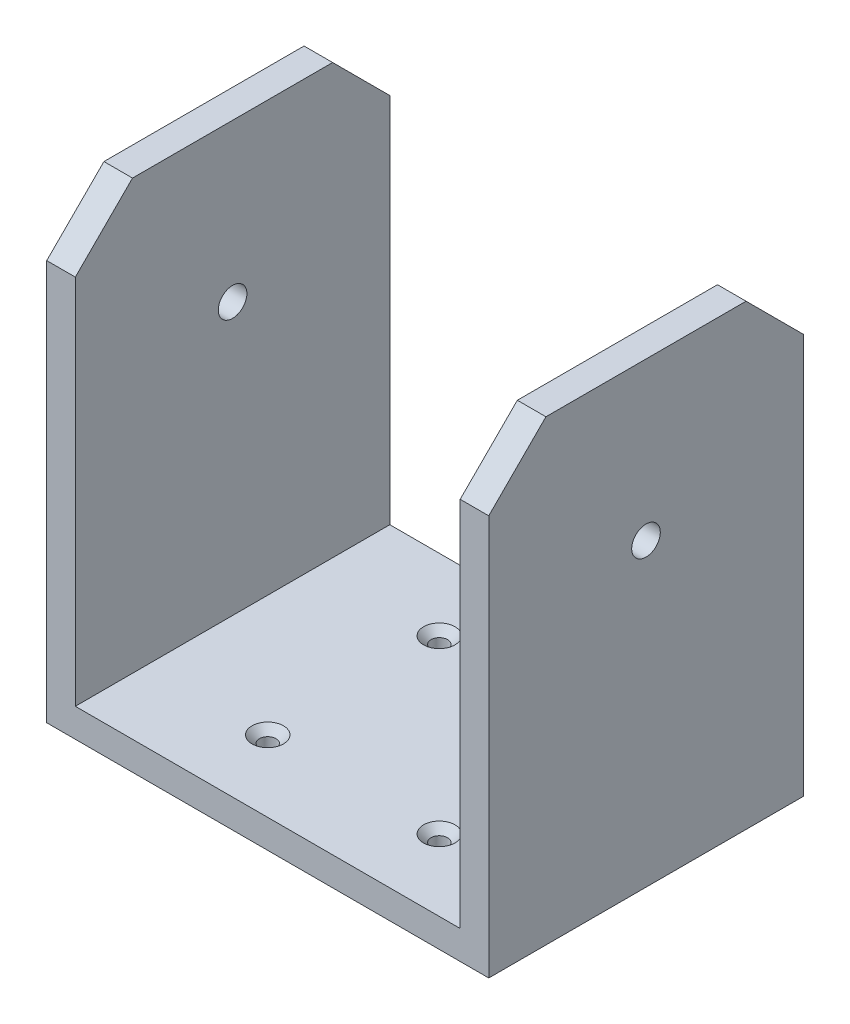
ISO-10303-21;
HEADER;
FILE_DESCRIPTION(('STEP AP214'),'2;1');
FILE_NAME('part.step','',(''),(''),'','','');
FILE_SCHEMA(('AUTOMOTIVE_DESIGN { 1 0 10303 214 1 1 1 1 }'));
ENDSEC;
DATA;
#1=APPLICATION_CONTEXT('core data for automotive mechanical design processes');
#2=APPLICATION_PROTOCOL_DEFINITION('international standard','automotive_design',2000,#1);
#3=PRODUCT_CONTEXT('',#1,'mechanical');
#4=PRODUCT('Part','Part','',(#3));
#5=PRODUCT_RELATED_PRODUCT_CATEGORY('part','',(#4));
#6=PRODUCT_DEFINITION_FORMATION('','',#4);
#7=PRODUCT_DEFINITION_CONTEXT('part definition',#1,'design');
#8=PRODUCT_DEFINITION('design','',#6,#7);
#9=PRODUCT_DEFINITION_SHAPE('','',#8);
#10=(LENGTH_UNIT() NAMED_UNIT(*) SI_UNIT(.MILLI.,.METRE.));
#11=(NAMED_UNIT(*) PLANE_ANGLE_UNIT() SI_UNIT($,.RADIAN.));
#12=(NAMED_UNIT(*) SI_UNIT($,.STERADIAN.) SOLID_ANGLE_UNIT());
#13=UNCERTAINTY_MEASURE_WITH_UNIT(LENGTH_MEASURE(1.E-05),#10,'distance_accuracy_value','');
#14=(GEOMETRIC_REPRESENTATION_CONTEXT(3) GLOBAL_UNCERTAINTY_ASSIGNED_CONTEXT((#13)) GLOBAL_UNIT_ASSIGNED_CONTEXT((#10,
#11,#12)) REPRESENTATION_CONTEXT('',''));
#15=CARTESIAN_POINT('',(0.,0.,0.));
#16=DIRECTION('',(0.,0.,1.));
#17=DIRECTION('',(1.,0.,0.));
#18=AXIS2_PLACEMENT_3D('',#15,#16,#17);
#19=CARTESIAN_POINT('',(5.,0.,0.));
#20=DIRECTION('',(1.,0.,0.));
#21=DIRECTION('',(0.,0.,-1.));
#22=AXIS2_PLACEMENT_3D('',#19,#20,#21);
#23=PLANE('',#22);
#24=DIRECTION('',(0.,1.,0.));
#25=VECTOR('',#24,1.);
#26=CARTESIAN_POINT('',(5.,17.5,-27.5));
#27=LINE('',#26,#25);
#28=CARTESIAN_POINT('',(5.,-52.5,-27.5));
#29=VERTEX_POINT('',#28);
#30=CARTESIAN_POINT('',(5.,17.5,-27.5));
#31=VERTEX_POINT('',#30);
#32=EDGE_CURVE('E194',#29,#31,#27,.T.);
#33=ORIENTED_EDGE('',*,*,#32,.T.);
#34=DIRECTION('',(0.,0.707106781186546,0.707106781186549));
#35=VECTOR('',#34,1.);
#36=CARTESIAN_POINT('',(5.,27.5,-17.5));
#37=LINE('',#36,#35);
#38=CARTESIAN_POINT('',(5.,27.5,-17.5));
#39=VERTEX_POINT('',#38);
#40=EDGE_CURVE('E87',#31,#39,#37,.T.);
#41=ORIENTED_EDGE('',*,*,#40,.T.);
#42=DIRECTION('',(0.,0.,1.));
#43=VECTOR('',#42,1.);
#44=CARTESIAN_POINT('',(5.,27.5,17.5000000000001));
#45=LINE('',#44,#43);
#46=CARTESIAN_POINT('',(5.,27.5,17.5000000000001));
#47=VERTEX_POINT('',#46);
#48=EDGE_CURVE('E197',#39,#47,#45,.T.);
#49=ORIENTED_EDGE('',*,*,#48,.T.);
#50=DIRECTION('',(0.,-0.707106781186552,0.707106781186543));
#51=VECTOR('',#50,1.);
#52=CARTESIAN_POINT('',(5.,17.5,27.5));
#53=LINE('',#52,#51);
#54=CARTESIAN_POINT('',(5.,17.5,27.5));
#55=VERTEX_POINT('',#54);
#56=EDGE_CURVE('E59',#47,#55,#53,.T.);
#57=ORIENTED_EDGE('',*,*,#56,.T.);
#58=DIRECTION('',(0.,-1.,0.));
#59=VECTOR('',#58,1.);
#60=CARTESIAN_POINT('',(5.,17.5,27.5));
#61=LINE('',#60,#59);
#62=CARTESIAN_POINT('',(5.,-52.5,27.5));
#63=VERTEX_POINT('',#62);
#64=EDGE_CURVE('E200',#55,#63,#61,.T.);
#65=ORIENTED_EDGE('',*,*,#64,.T.);
#66=DIRECTION('',(0.,0.,1.));
#67=VECTOR('',#66,1.);
#68=CARTESIAN_POINT('',(5.,-52.5,27.5));
#69=LINE('',#68,#67);
#70=EDGE_CURVE('E182',#29,#63,#69,.T.);
#71=ORIENTED_EDGE('',*,*,#70,.F.);
#72=EDGE_LOOP('',(#33,#41,#49,#57,#65,#71));
#73=FACE_BOUND('',#72,.T.);
#74=CARTESIAN_POINT('',(5.,0.,0.));
#75=DIRECTION('',(1.,0.,0.));
#76=DIRECTION('',(0.,0.,-1.));
#77=AXIS2_PLACEMENT_3D('',#74,#75,#76);
#78=CIRCLE('',#77,2.5);
#79=CARTESIAN_POINT('',(5.,0.,-2.5));
#80=VERTEX_POINT('',#79);
#81=EDGE_CURVE('E188',#80,#80,#78,.T.);
#82=ORIENTED_EDGE('',*,*,#81,.F.);
#83=EDGE_LOOP('',(#82));
#84=FACE_BOUND('',#83,.T.);
#85=ADVANCED_FACE('F33',(#73,#84),#23,.T.);
#86=CARTESIAN_POINT('',(0.,0.,0.));
#87=DIRECTION('',(1.,0.,0.));
#88=DIRECTION('',(0.,0.,-1.));
#89=AXIS2_PLACEMENT_3D('',#86,#87,#88);
#90=PLANE('',#89);
#91=DIRECTION('',(0.,1.,0.));
#92=VECTOR('',#91,1.);
#93=CARTESIAN_POINT('',(0.,17.5,-27.5));
#94=LINE('',#93,#92);
#95=CARTESIAN_POINT('',(0.,-47.5,-27.5));
#96=VERTEX_POINT('',#95);
#97=CARTESIAN_POINT('',(0.,17.5,-27.5));
#98=VERTEX_POINT('',#97);
#99=EDGE_CURVE('E191',#96,#98,#94,.T.);
#100=ORIENTED_EDGE('',*,*,#99,.F.);
#101=DIRECTION('',(0.,0.,1.));
#102=VECTOR('',#101,1.);
#103=CARTESIAN_POINT('',(0.,-47.5,27.5));
#104=LINE('',#103,#102);
#105=CARTESIAN_POINT('',(0.,-47.4999999999999,27.5));
#106=VERTEX_POINT('',#105);
#107=EDGE_CURVE('E151',#96,#106,#104,.T.);
#108=ORIENTED_EDGE('',*,*,#107,.T.);
#109=DIRECTION('',(0.,-1.,0.));
#110=VECTOR('',#109,1.);
#111=CARTESIAN_POINT('',(0.,17.5,27.5));
#112=LINE('',#111,#110);
#113=CARTESIAN_POINT('',(0.,17.5,27.5));
#114=VERTEX_POINT('',#113);
#115=EDGE_CURVE('E167',#114,#106,#112,.T.);
#116=ORIENTED_EDGE('',*,*,#115,.F.);
#117=DIRECTION('',(0.,-0.707106781186552,0.707106781186543));
#118=VECTOR('',#117,1.);
#119=CARTESIAN_POINT('',(0.,17.5,27.5));
#120=LINE('',#119,#118);
#121=CARTESIAN_POINT('',(0.,27.5,17.5000000000001));
#122=VERTEX_POINT('',#121);
#123=EDGE_CURVE('E80',#122,#114,#120,.T.);
#124=ORIENTED_EDGE('',*,*,#123,.F.);
#125=DIRECTION('',(0.,0.,1.));
#126=VECTOR('',#125,1.);
#127=CARTESIAN_POINT('',(0.,27.5,17.5000000000001));
#128=LINE('',#127,#126);
#129=CARTESIAN_POINT('',(0.,27.5,-17.5));
#130=VERTEX_POINT('',#129);
#131=EDGE_CURVE('E214',#130,#122,#128,.T.);
#132=ORIENTED_EDGE('',*,*,#131,.F.);
#133=DIRECTION('',(0.,0.707106781186546,0.707106781186549));
#134=VECTOR('',#133,1.);
#135=CARTESIAN_POINT('',(0.,27.5,-17.5));
#136=LINE('',#135,#134);
#137=EDGE_CURVE('E205',#98,#130,#136,.T.);
#138=ORIENTED_EDGE('',*,*,#137,.F.);
#139=EDGE_LOOP('',(#100,#108,#116,#124,#132,#138));
#140=FACE_BOUND('',#139,.T.);
#141=CARTESIAN_POINT('',(0.,0.,0.));
#142=DIRECTION('',(1.,0.,0.));
#143=DIRECTION('',(0.,0.,-1.));
#144=AXIS2_PLACEMENT_3D('',#141,#142,#143);
#145=CIRCLE('',#144,2.5);
#146=CARTESIAN_POINT('',(0.,0.,-2.5));
#147=VERTEX_POINT('',#146);
#148=EDGE_CURVE('E187',#147,#147,#145,.T.);
#149=ORIENTED_EDGE('',*,*,#148,.T.);
#150=EDGE_LOOP('',(#149));
#151=FACE_BOUND('',#150,.T.);
#152=ADVANCED_FACE('F224',(#140,#151),#90,.F.);
#153=CARTESIAN_POINT('',(5.,17.5,-27.5));
#154=DIRECTION('',(0.,0.,1.));
#155=DIRECTION('',(1.,0.,0.));
#156=AXIS2_PLACEMENT_3D('',#153,#154,#155);
#157=PLANE('',#156);
#158=DIRECTION('',(1.,0.,0.));
#159=VECTOR('',#158,1.);
#160=CARTESIAN_POINT('',(0.,-52.5,-27.5));
#161=LINE('',#160,#159);
#162=CARTESIAN_POINT('',(-72.3,-52.5,-27.5));
#163=VERTEX_POINT('',#162);
#164=EDGE_CURVE('E178',#163,#29,#161,.T.);
#165=ORIENTED_EDGE('',*,*,#164,.F.);
#166=DIRECTION('',(0.,-1.,0.));
#167=VECTOR('',#166,1.);
#168=CARTESIAN_POINT('',(-72.3,-47.5,-27.5));
#169=LINE('',#168,#167);
#170=CARTESIAN_POINT('',(-72.3,17.5,-27.5));
#171=VERTEX_POINT('',#170);
#172=EDGE_CURVE('E155',#171,#163,#169,.T.);
#173=ORIENTED_EDGE('',*,*,#172,.F.);
#174=DIRECTION('',(-1.,0.,0.));
#175=VECTOR('',#174,1.);
#176=CARTESIAN_POINT('',(-67.3,17.5,-27.5));
#177=LINE('',#176,#175);
#178=CARTESIAN_POINT('',(-67.3,17.5,-27.5));
#179=VERTEX_POINT('',#178);
#180=EDGE_CURVE('E147',#179,#171,#177,.T.);
#181=ORIENTED_EDGE('',*,*,#180,.F.);
#182=DIRECTION('',(0.,-1.,0.));
#183=VECTOR('',#182,1.);
#184=CARTESIAN_POINT('',(-67.3,-47.5,-27.5));
#185=LINE('',#184,#183);
#186=CARTESIAN_POINT('',(-67.3,-47.5,-27.5));
#187=VERTEX_POINT('',#186);
#188=EDGE_CURVE('E138',#179,#187,#185,.T.);
#189=ORIENTED_EDGE('',*,*,#188,.T.);
#190=DIRECTION('',(1.,0.,0.));
#191=VECTOR('',#190,1.);
#192=CARTESIAN_POINT('',(0.,-47.5,-27.5));
#193=LINE('',#192,#191);
#194=EDGE_CURVE('E37',#187,#96,#193,.T.);
#195=ORIENTED_EDGE('',*,*,#194,.T.);
#196=ORIENTED_EDGE('',*,*,#99,.T.);
#197=DIRECTION('',(-1.,0.,0.));
#198=VECTOR('',#197,1.);
#199=CARTESIAN_POINT('',(5.,17.5,-27.5));
#200=LINE('',#199,#198);
#201=EDGE_CURVE('E11',#31,#98,#200,.T.);
#202=ORIENTED_EDGE('',*,*,#201,.F.);
#203=ORIENTED_EDGE('',*,*,#32,.F.);
#204=EDGE_LOOP('',(#165,#173,#181,#189,#195,#196,#202,#203));
#205=FACE_BOUND('',#204,.T.);
#206=ADVANCED_FACE('F35',(#205),#157,.F.);
#207=CARTESIAN_POINT('',(5.,27.5,-17.5));
#208=DIRECTION('',(0.,-0.707106781186549,0.707106781186546));
#209=DIRECTION('',(0.,-0.707106781186546,-0.707106781186549));
#210=AXIS2_PLACEMENT_3D('',#207,#208,#209);
#211=PLANE('',#210);
#212=ORIENTED_EDGE('',*,*,#137,.T.);
#213=DIRECTION('',(-1.,0.,0.));
#214=VECTOR('',#213,1.);
#215=CARTESIAN_POINT('',(5.,27.5,-17.5));
#216=LINE('',#215,#214);
#217=EDGE_CURVE('E42',#39,#130,#216,.T.);
#218=ORIENTED_EDGE('',*,*,#217,.F.);
#219=ORIENTED_EDGE('',*,*,#40,.F.);
#220=ORIENTED_EDGE('',*,*,#201,.T.);
#221=EDGE_LOOP('',(#212,#218,#219,#220));
#222=FACE_BOUND('',#221,.T.);
#223=ADVANCED_FACE('F219',(#222),#211,.F.);
#224=CARTESIAN_POINT('',(5.,27.5,17.5000000000001));
#225=DIRECTION('',(0.,-1.,0.));
#226=DIRECTION('',(0.,0.,-1.));
#227=AXIS2_PLACEMENT_3D('',#224,#225,#226);
#228=PLANE('',#227);
#229=ORIENTED_EDGE('',*,*,#131,.T.);
#230=DIRECTION('',(-1.,0.,0.));
#231=VECTOR('',#230,1.);
#232=CARTESIAN_POINT('',(5.,27.5,17.5000000000001));
#233=LINE('',#232,#231);
#234=EDGE_CURVE('E210',#47,#122,#233,.T.);
#235=ORIENTED_EDGE('',*,*,#234,.F.);
#236=ORIENTED_EDGE('',*,*,#48,.F.);
#237=ORIENTED_EDGE('',*,*,#217,.T.);
#238=EDGE_LOOP('',(#229,#235,#236,#237));
#239=FACE_BOUND('',#238,.T.);
#240=ADVANCED_FACE('F223',(#239),#228,.F.);
#241=CARTESIAN_POINT('',(5.,17.5,27.5));
#242=DIRECTION('',(0.,-0.707106781186543,-0.707106781186552));
#243=DIRECTION('',(0.,0.707106781186552,-0.707106781186543));
#244=AXIS2_PLACEMENT_3D('',#241,#242,#243);
#245=PLANE('',#244);
#246=ORIENTED_EDGE('',*,*,#123,.T.);
#247=DIRECTION('',(-1.,0.,0.));
#248=VECTOR('',#247,1.);
#249=CARTESIAN_POINT('',(5.,17.5,27.5));
#250=LINE('',#249,#248);
#251=EDGE_CURVE('E202',#55,#114,#250,.T.);
#252=ORIENTED_EDGE('',*,*,#251,.F.);
#253=ORIENTED_EDGE('',*,*,#56,.F.);
#254=ORIENTED_EDGE('',*,*,#234,.T.);
#255=EDGE_LOOP('',(#246,#252,#253,#254));
#256=FACE_BOUND('',#255,.T.);
#257=ADVANCED_FACE('F230',(#256),#245,.F.);
#258=CARTESIAN_POINT('',(5.,17.5,27.5));
#259=DIRECTION('',(0.,0.,-1.));
#260=DIRECTION('',(0.,1.,0.));
#261=AXIS2_PLACEMENT_3D('',#258,#259,#260);
#262=PLANE('',#261);
#263=ORIENTED_EDGE('',*,*,#115,.T.);
#264=DIRECTION('',(-1.,0.,0.));
#265=VECTOR('',#264,1.);
#266=CARTESIAN_POINT('',(0.,-47.5,27.5));
#267=LINE('',#266,#265);
#268=CARTESIAN_POINT('',(-67.3,-47.5,27.4999999999999));
#269=VERTEX_POINT('',#268);
#270=EDGE_CURVE('E50',#106,#269,#267,.T.);
#271=ORIENTED_EDGE('',*,*,#270,.T.);
#272=DIRECTION('',(0.,1.,0.));
#273=VECTOR('',#272,1.);
#274=CARTESIAN_POINT('',(-67.3,-47.5,27.4999999999999));
#275=LINE('',#274,#273);
#276=CARTESIAN_POINT('',(-67.3,17.5,27.5));
#277=VERTEX_POINT('',#276);
#278=EDGE_CURVE('E142',#269,#277,#275,.T.);
#279=ORIENTED_EDGE('',*,*,#278,.T.);
#280=DIRECTION('',(-1.,0.,0.));
#281=VECTOR('',#280,1.);
#282=CARTESIAN_POINT('',(-67.3,17.5,27.5));
#283=LINE('',#282,#281);
#284=CARTESIAN_POINT('',(-72.3,17.5,27.5));
#285=VERTEX_POINT('',#284);
#286=EDGE_CURVE('E173',#277,#285,#283,.T.);
#287=ORIENTED_EDGE('',*,*,#286,.T.);
#288=DIRECTION('',(0.,-1.,0.));
#289=VECTOR('',#288,1.);
#290=CARTESIAN_POINT('',(-72.3,-47.5,27.5));
#291=LINE('',#290,#289);
#292=CARTESIAN_POINT('',(-72.3,-52.5,27.5));
#293=VERTEX_POINT('',#292);
#294=EDGE_CURVE('E153',#285,#293,#291,.T.);
#295=ORIENTED_EDGE('',*,*,#294,.T.);
#296=DIRECTION('',(-1.,0.,0.));
#297=VECTOR('',#296,1.);
#298=CARTESIAN_POINT('',(0.,-52.5,27.5));
#299=LINE('',#298,#297);
#300=EDGE_CURVE('E185',#63,#293,#299,.T.);
#301=ORIENTED_EDGE('',*,*,#300,.F.);
#302=ORIENTED_EDGE('',*,*,#64,.F.);
#303=ORIENTED_EDGE('',*,*,#251,.T.);
#304=EDGE_LOOP('',(#263,#271,#279,#287,#295,#301,#302,#303));
#305=FACE_BOUND('',#304,.T.);
#306=ADVANCED_FACE('F227',(#305),#262,.F.);
#307=CARTESIAN_POINT('',(5.,0.,0.));
#308=DIRECTION('',(-1.,0.,0.));
#309=DIRECTION('',(0.,0.,1.));
#310=AXIS2_PLACEMENT_3D('',#307,#308,#309);
#311=CYLINDRICAL_SURFACE('',#310,2.5);
#312=ORIENTED_EDGE('',*,*,#81,.T.);
#313=EDGE_LOOP('',(#312));
#314=FACE_BOUND('',#313,.T.);
#315=ORIENTED_EDGE('',*,*,#148,.F.);
#316=EDGE_LOOP('',(#315));
#317=FACE_BOUND('',#316,.T.);
#318=ADVANCED_FACE('F238',(#314,#317),#311,.F.);
#319=CARTESIAN_POINT('',(0.,-52.5,0.));
#320=DIRECTION('',(0.,-1.,0.));
#321=DIRECTION('',(0.,0.,-1.));
#322=AXIS2_PLACEMENT_3D('',#319,#320,#321);
#323=PLANE('',#322);
#324=CARTESIAN_POINT('',(-16.1500000000002,-52.5,-15.));
#325=DIRECTION('',(0.,1.,0.));
#326=DIRECTION('',(0.,0.,1.));
#327=AXIS2_PLACEMENT_3D('',#324,#325,#326);
#328=CIRCLE('',#327,1.44999999999999);
#329=CARTESIAN_POINT('',(-16.1500000000002,-52.5,-13.55));
#330=VERTEX_POINT('',#329);
#331=EDGE_CURVE('E323',#330,#330,#328,.T.);
#332=ORIENTED_EDGE('',*,*,#331,.T.);
#333=EDGE_LOOP('',(#332));
#334=FACE_BOUND('',#333,.T.);
#335=CARTESIAN_POINT('',(-16.1500000000002,-52.5,15.));
#336=DIRECTION('',(0.,1.,0.));
#337=DIRECTION('',(0.,0.,1.));
#338=AXIS2_PLACEMENT_3D('',#335,#336,#337);
#339=CIRCLE('',#338,1.44999999999999);
#340=CARTESIAN_POINT('',(-16.1500000000002,-52.5,16.45));
#341=VERTEX_POINT('',#340);
#342=EDGE_CURVE('E334',#341,#341,#339,.T.);
#343=ORIENTED_EDGE('',*,*,#342,.T.);
#344=EDGE_LOOP('',(#343));
#345=FACE_BOUND('',#344,.T.);
#346=CARTESIAN_POINT('',(-46.1500000000001,-52.5,15.));
#347=DIRECTION('',(0.,1.,0.));
#348=DIRECTION('',(0.,0.,1.));
#349=AXIS2_PLACEMENT_3D('',#346,#347,#348);
#350=CIRCLE('',#349,1.44999999999999);
#351=CARTESIAN_POINT('',(-46.1500000000001,-52.5,16.45));
#352=VERTEX_POINT('',#351);
#353=EDGE_CURVE('E343',#352,#352,#350,.T.);
#354=ORIENTED_EDGE('',*,*,#353,.T.);
#355=EDGE_LOOP('',(#354));
#356=FACE_BOUND('',#355,.T.);
#357=CARTESIAN_POINT('',(-46.1500000000001,-52.5,-15.));
#358=DIRECTION('',(0.,1.,0.));
#359=DIRECTION('',(0.,0.,1.));
#360=AXIS2_PLACEMENT_3D('',#357,#358,#359);
#361=CIRCLE('',#360,1.44999999999999);
#362=CARTESIAN_POINT('',(-46.1500000000001,-52.5,-13.55));
#363=VERTEX_POINT('',#362);
#364=EDGE_CURVE('E352',#363,#363,#361,.T.);
#365=ORIENTED_EDGE('',*,*,#364,.T.);
#366=EDGE_LOOP('',(#365));
#367=FACE_BOUND('',#366,.T.);
#368=ORIENTED_EDGE('',*,*,#300,.T.);
#369=DIRECTION('',(0.,0.,-1.));
#370=VECTOR('',#369,1.);
#371=CARTESIAN_POINT('',(-72.3,-52.5,27.5));
#372=LINE('',#371,#370);
#373=EDGE_CURVE('E160',#293,#163,#372,.T.);
#374=ORIENTED_EDGE('',*,*,#373,.T.);
#375=ORIENTED_EDGE('',*,*,#164,.T.);
#376=ORIENTED_EDGE('',*,*,#70,.T.);
#377=EDGE_LOOP('',(#368,#374,#375,#376));
#378=FACE_BOUND('',#377,.T.);
#379=ADVANCED_FACE('F251',(#334,#345,#356,#367,#378),#323,.T.);
#380=CARTESIAN_POINT('',(-72.3,-47.5,27.5));
#381=DIRECTION('',(-1.,0.,0.));
#382=DIRECTION('',(0.,0.,1.));
#383=AXIS2_PLACEMENT_3D('',#380,#381,#382);
#384=PLANE('',#383);
#385=CARTESIAN_POINT('',(-72.3,0.,0.));
#386=DIRECTION('',(-1.,0.,0.));
#387=DIRECTION('',(0.,0.,1.));
#388=AXIS2_PLACEMENT_3D('',#385,#386,#387);
#389=CIRCLE('',#388,2.5);
#390=CARTESIAN_POINT('',(-72.3,0.,2.5));
#391=VERTEX_POINT('',#390);
#392=EDGE_CURVE('E355',#391,#391,#389,.F.);
#393=ORIENTED_EDGE('',*,*,#392,.T.);
#394=EDGE_LOOP('',(#393));
#395=FACE_BOUND('',#394,.T.);
#396=ORIENTED_EDGE('',*,*,#373,.F.);
#397=ORIENTED_EDGE('',*,*,#294,.F.);
#398=DIRECTION('',(0.,0.707106781186552,-0.707106781186543));
#399=VECTOR('',#398,1.);
#400=CARTESIAN_POINT('',(-72.3,27.5,17.5000000000001));
#401=LINE('',#400,#399);
#402=CARTESIAN_POINT('',(-72.3,27.5,17.5000000000001));
#403=VERTEX_POINT('',#402);
#404=EDGE_CURVE('E359',#285,#403,#401,.T.);
#405=ORIENTED_EDGE('',*,*,#404,.T.);
#406=DIRECTION('',(0.,0.,-1.));
#407=VECTOR('',#406,1.);
#408=CARTESIAN_POINT('',(-72.3,27.5,-17.5));
#409=LINE('',#408,#407);
#410=CARTESIAN_POINT('',(-72.3,27.5,-17.5));
#411=VERTEX_POINT('',#410);
#412=EDGE_CURVE('E373',#403,#411,#409,.T.);
#413=ORIENTED_EDGE('',*,*,#412,.T.);
#414=DIRECTION('',(0.,-0.707106781186546,-0.707106781186549));
#415=VECTOR('',#414,1.);
#416=CARTESIAN_POINT('',(-72.3,27.5,-17.5));
#417=LINE('',#416,#415);
#418=EDGE_CURVE('E148',#411,#171,#417,.T.);
#419=ORIENTED_EDGE('',*,*,#418,.T.);
#420=ORIENTED_EDGE('',*,*,#172,.T.);
#421=EDGE_LOOP('',(#396,#397,#405,#413,#419,#420));
#422=FACE_BOUND('',#421,.T.);
#423=ADVANCED_FACE('F255',(#395,#422),#384,.T.);
#424=CARTESIAN_POINT('',(0.,-47.5,0.));
#425=DIRECTION('',(0.,1.,0.));
#426=DIRECTION('',(0.,0.,1.));
#427=AXIS2_PLACEMENT_3D('',#424,#425,#426);
#428=PLANE('',#427);
#429=CARTESIAN_POINT('',(-16.1500000000002,-47.5,-15.));
#430=DIRECTION('',(0.,1.,0.));
#431=DIRECTION('',(0.,0.,1.));
#432=AXIS2_PLACEMENT_3D('',#429,#430,#431);
#433=CIRCLE('',#432,2.75);
#434=CARTESIAN_POINT('',(-16.1500000000002,-47.5,-12.25));
#435=VERTEX_POINT('',#434);
#436=EDGE_CURVE('E321',#435,#435,#433,.T.);
#437=ORIENTED_EDGE('',*,*,#436,.F.);
#438=EDGE_LOOP('',(#437));
#439=FACE_BOUND('',#438,.T.);
#440=CARTESIAN_POINT('',(-16.1500000000002,-47.5,15.));
#441=DIRECTION('',(0.,1.,0.));
#442=DIRECTION('',(0.,0.,1.));
#443=AXIS2_PLACEMENT_3D('',#440,#441,#442);
#444=CIRCLE('',#443,2.75);
#445=CARTESIAN_POINT('',(-16.1500000000002,-47.5,17.75));
#446=VERTEX_POINT('',#445);
#447=EDGE_CURVE('E328',#446,#446,#444,.T.);
#448=ORIENTED_EDGE('',*,*,#447,.F.);
#449=EDGE_LOOP('',(#448));
#450=FACE_BOUND('',#449,.T.);
#451=CARTESIAN_POINT('',(-46.1500000000001,-47.5,15.));
#452=DIRECTION('',(0.,1.,0.));
#453=DIRECTION('',(0.,0.,1.));
#454=AXIS2_PLACEMENT_3D('',#451,#452,#453);
#455=CIRCLE('',#454,2.75);
#456=CARTESIAN_POINT('',(-46.1500000000001,-47.5,17.75));
#457=VERTEX_POINT('',#456);
#458=EDGE_CURVE('E337',#457,#457,#455,.T.);
#459=ORIENTED_EDGE('',*,*,#458,.F.);
#460=EDGE_LOOP('',(#459));
#461=FACE_BOUND('',#460,.T.);
#462=CARTESIAN_POINT('',(-46.1500000000001,-47.5,-15.));
#463=DIRECTION('',(0.,1.,0.));
#464=DIRECTION('',(0.,0.,1.));
#465=AXIS2_PLACEMENT_3D('',#462,#463,#464);
#466=CIRCLE('',#465,2.75);
#467=CARTESIAN_POINT('',(-46.1500000000001,-47.5,-12.25));
#468=VERTEX_POINT('',#467);
#469=EDGE_CURVE('E346',#468,#468,#466,.T.);
#470=ORIENTED_EDGE('',*,*,#469,.F.);
#471=EDGE_LOOP('',(#470));
#472=FACE_BOUND('',#471,.T.);
#473=DIRECTION('',(0.,0.,1.));
#474=VECTOR('',#473,1.);
#475=CARTESIAN_POINT('',(-67.3,-47.5,-27.5));
#476=LINE('',#475,#474);
#477=EDGE_CURVE('E134',#187,#269,#476,.T.);
#478=ORIENTED_EDGE('',*,*,#477,.T.);
#479=ORIENTED_EDGE('',*,*,#270,.F.);
#480=ORIENTED_EDGE('',*,*,#107,.F.);
#481=ORIENTED_EDGE('',*,*,#194,.F.);
#482=EDGE_LOOP('',(#478,#479,#480,#481));
#483=FACE_BOUND('',#482,.T.);
#484=ADVANCED_FACE('F150',(#439,#450,#461,#472,#483),#428,.T.);
#485=CARTESIAN_POINT('',(-67.3,27.5,-17.5));
#486=DIRECTION('',(0.,0.70710678118655,-0.707106781186546));
#487=DIRECTION('',(0.,0.707106781186546,0.70710678118655));
#488=AXIS2_PLACEMENT_3D('',#485,#486,#487);
#489=PLANE('',#488);
#490=ORIENTED_EDGE('',*,*,#418,.F.);
#491=DIRECTION('',(-1.,0.,0.));
#492=VECTOR('',#491,1.);
#493=CARTESIAN_POINT('',(-67.3,27.5,-17.5));
#494=LINE('',#493,#492);
#495=CARTESIAN_POINT('',(-67.3,27.5,-17.5));
#496=VERTEX_POINT('',#495);
#497=EDGE_CURVE('E379',#496,#411,#494,.T.);
#498=ORIENTED_EDGE('',*,*,#497,.F.);
#499=DIRECTION('',(0.,-0.707106781186546,-0.707106781186549));
#500=VECTOR('',#499,1.);
#501=CARTESIAN_POINT('',(-67.3,27.5,-17.5));
#502=LINE('',#501,#500);
#503=EDGE_CURVE('E369',#496,#179,#502,.T.);
#504=ORIENTED_EDGE('',*,*,#503,.T.);
#505=ORIENTED_EDGE('',*,*,#180,.T.);
#506=EDGE_LOOP('',(#490,#498,#504,#505));
#507=FACE_BOUND('',#506,.T.);
#508=ADVANCED_FACE('F262',(#507),#489,.T.);
#509=CARTESIAN_POINT('',(-67.3,27.5,-17.5));
#510=DIRECTION('',(0.,1.,0.));
#511=DIRECTION('',(0.,0.,1.));
#512=AXIS2_PLACEMENT_3D('',#509,#510,#511);
#513=PLANE('',#512);
#514=ORIENTED_EDGE('',*,*,#412,.F.);
#515=DIRECTION('',(-1.,0.,0.));
#516=VECTOR('',#515,1.);
#517=CARTESIAN_POINT('',(-67.3,27.5,17.5000000000001));
#518=LINE('',#517,#516);
#519=CARTESIAN_POINT('',(-67.3,27.5,17.5000000000001));
#520=VERTEX_POINT('',#519);
#521=EDGE_CURVE('E380',#520,#403,#518,.T.);
#522=ORIENTED_EDGE('',*,*,#521,.F.);
#523=DIRECTION('',(0.,0.,-1.));
#524=VECTOR('',#523,1.);
#525=CARTESIAN_POINT('',(-67.3,27.5,-17.5));
#526=LINE('',#525,#524);
#527=EDGE_CURVE('E366',#520,#496,#526,.T.);
#528=ORIENTED_EDGE('',*,*,#527,.T.);
#529=ORIENTED_EDGE('',*,*,#497,.T.);
#530=EDGE_LOOP('',(#514,#522,#528,#529));
#531=FACE_BOUND('',#530,.T.);
#532=ADVANCED_FACE('F267',(#531),#513,.T.);
#533=CARTESIAN_POINT('',(-67.3,27.5,17.5000000000001));
#534=DIRECTION('',(0.,0.707106781186544,0.707106781186552));
#535=DIRECTION('',(0.,-0.707106781186552,0.707106781186544));
#536=AXIS2_PLACEMENT_3D('',#533,#534,#535);
#537=PLANE('',#536);
#538=ORIENTED_EDGE('',*,*,#404,.F.);
#539=ORIENTED_EDGE('',*,*,#286,.F.);
#540=DIRECTION('',(0.,0.707106781186552,-0.707106781186543));
#541=VECTOR('',#540,1.);
#542=CARTESIAN_POINT('',(-67.3,27.5,17.5000000000001));
#543=LINE('',#542,#541);
#544=EDGE_CURVE('E363',#277,#520,#543,.T.);
#545=ORIENTED_EDGE('',*,*,#544,.T.);
#546=ORIENTED_EDGE('',*,*,#521,.T.);
#547=EDGE_LOOP('',(#538,#539,#545,#546));
#548=FACE_BOUND('',#547,.T.);
#549=ADVANCED_FACE('F264',(#548),#537,.T.);
#550=CARTESIAN_POINT('',(-67.3,0.,0.));
#551=DIRECTION('',(1.,0.,0.));
#552=DIRECTION('',(0.,0.,-1.));
#553=AXIS2_PLACEMENT_3D('',#550,#551,#552);
#554=PLANE('',#553);
#555=CARTESIAN_POINT('',(-67.3,0.,0.));
#556=DIRECTION('',(1.,0.,0.));
#557=DIRECTION('',(0.,0.,-1.));
#558=AXIS2_PLACEMENT_3D('',#555,#556,#557);
#559=CIRCLE('',#558,2.5);
#560=CARTESIAN_POINT('',(-67.3,0.,-2.5));
#561=VERTEX_POINT('',#560);
#562=EDGE_CURVE('E356',#561,#561,#559,.T.);
#563=ORIENTED_EDGE('',*,*,#562,.F.);
#564=EDGE_LOOP('',(#563));
#565=FACE_BOUND('',#564,.T.);
#566=ORIENTED_EDGE('',*,*,#188,.F.);
#567=ORIENTED_EDGE('',*,*,#503,.F.);
#568=ORIENTED_EDGE('',*,*,#527,.F.);
#569=ORIENTED_EDGE('',*,*,#544,.F.);
#570=ORIENTED_EDGE('',*,*,#278,.F.);
#571=ORIENTED_EDGE('',*,*,#477,.F.);
#572=EDGE_LOOP('',(#566,#567,#568,#569,#570,#571));
#573=FACE_BOUND('',#572,.T.);
#574=ADVANCED_FACE('F136',(#565,#573),#554,.T.);
#575=CARTESIAN_POINT('',(-72.301,0.,0.));
#576=DIRECTION('',(1.,0.,0.));
#577=DIRECTION('',(0.,0.,-1.));
#578=AXIS2_PLACEMENT_3D('',#575,#576,#577);
#579=CYLINDRICAL_SURFACE('',#578,2.5);
#580=ORIENTED_EDGE('',*,*,#392,.F.);
#581=EDGE_LOOP('',(#580));
#582=FACE_BOUND('',#581,.T.);
#583=ORIENTED_EDGE('',*,*,#562,.T.);
#584=EDGE_LOOP('',(#583));
#585=FACE_BOUND('',#584,.T.);
#586=ADVANCED_FACE('F277',(#582,#585),#579,.F.);
#587=CARTESIAN_POINT('',(-46.1500000000001,-47.5,-15.));
#588=DIRECTION('',(0.,1.,0.));
#589=DIRECTION('',(0.,0.,1.));
#590=AXIS2_PLACEMENT_3D('',#587,#588,#589);
#591=CYLINDRICAL_SURFACE('',#590,1.44999999999999);
#592=ORIENTED_EDGE('',*,*,#364,.F.);
#593=EDGE_LOOP('',(#592));
#594=FACE_BOUND('',#593,.T.);
#595=CARTESIAN_POINT('',(-46.1500000000001,-48.8,-15.));
#596=DIRECTION('',(0.,1.,0.));
#597=DIRECTION('',(0.,0.,1.));
#598=AXIS2_PLACEMENT_3D('',#595,#596,#597);
#599=CIRCLE('',#598,1.44999999999999);
#600=CARTESIAN_POINT('',(-46.1500000000001,-48.8,-13.55));
#601=VERTEX_POINT('',#600);
#602=EDGE_CURVE('E349',#601,#601,#599,.T.);
#603=ORIENTED_EDGE('',*,*,#602,.T.);
#604=EDGE_LOOP('',(#603));
#605=FACE_BOUND('',#604,.T.);
#606=ADVANCED_FACE('F281',(#594,#605),#591,.F.);
#607=CARTESIAN_POINT('',(-46.1500000000001,-47.5,-15.));
#608=DIRECTION('',(0.,1.,0.));
#609=DIRECTION('',(0.,0.,1.));
#610=AXIS2_PLACEMENT_3D('',#607,#608,#609);
#611=CONICAL_SURFACE('',#610,2.75,0.785398163397451);
#612=ORIENTED_EDGE('',*,*,#602,.F.);
#613=EDGE_LOOP('',(#612));
#614=FACE_BOUND('',#613,.T.);
#615=ORIENTED_EDGE('',*,*,#469,.T.);
#616=EDGE_LOOP('',(#615));
#617=FACE_BOUND('',#616,.T.);
#618=ADVANCED_FACE('F285',(#614,#617),#611,.F.);
#619=CARTESIAN_POINT('',(-46.1500000000001,-47.5,15.));
#620=DIRECTION('',(0.,1.,0.));
#621=DIRECTION('',(0.,0.,1.));
#622=AXIS2_PLACEMENT_3D('',#619,#620,#621);
#623=CYLINDRICAL_SURFACE('',#622,1.44999999999999);
#624=ORIENTED_EDGE('',*,*,#353,.F.);
#625=EDGE_LOOP('',(#624));
#626=FACE_BOUND('',#625,.T.);
#627=CARTESIAN_POINT('',(-46.1500000000001,-48.8,15.));
#628=DIRECTION('',(0.,1.,0.));
#629=DIRECTION('',(0.,0.,1.));
#630=AXIS2_PLACEMENT_3D('',#627,#628,#629);
#631=CIRCLE('',#630,1.44999999999999);
#632=CARTESIAN_POINT('',(-46.1500000000001,-48.8,16.45));
#633=VERTEX_POINT('',#632);
#634=EDGE_CURVE('E340',#633,#633,#631,.T.);
#635=ORIENTED_EDGE('',*,*,#634,.T.);
#636=EDGE_LOOP('',(#635));
#637=FACE_BOUND('',#636,.T.);
#638=ADVANCED_FACE('F289',(#626,#637),#623,.F.);
#639=CARTESIAN_POINT('',(-46.1500000000001,-47.5,15.));
#640=DIRECTION('',(0.,1.,0.));
#641=DIRECTION('',(0.,0.,1.));
#642=AXIS2_PLACEMENT_3D('',#639,#640,#641);
#643=CONICAL_SURFACE('',#642,2.75,0.785398163397451);
#644=ORIENTED_EDGE('',*,*,#634,.F.);
#645=EDGE_LOOP('',(#644));
#646=FACE_BOUND('',#645,.T.);
#647=ORIENTED_EDGE('',*,*,#458,.T.);
#648=EDGE_LOOP('',(#647));
#649=FACE_BOUND('',#648,.T.);
#650=ADVANCED_FACE('F293',(#646,#649),#643,.F.);
#651=CARTESIAN_POINT('',(-16.1500000000002,-47.5,15.));
#652=DIRECTION('',(0.,1.,0.));
#653=DIRECTION('',(0.,0.,1.));
#654=AXIS2_PLACEMENT_3D('',#651,#652,#653);
#655=CYLINDRICAL_SURFACE('',#654,1.44999999999999);
#656=ORIENTED_EDGE('',*,*,#342,.F.);
#657=EDGE_LOOP('',(#656));
#658=FACE_BOUND('',#657,.T.);
#659=CARTESIAN_POINT('',(-16.1500000000002,-48.8,15.));
#660=DIRECTION('',(0.,1.,0.));
#661=DIRECTION('',(0.,0.,1.));
#662=AXIS2_PLACEMENT_3D('',#659,#660,#661);
#663=CIRCLE('',#662,1.44999999999999);
#664=CARTESIAN_POINT('',(-16.1500000000002,-48.8,16.45));
#665=VERTEX_POINT('',#664);
#666=EDGE_CURVE('E331',#665,#665,#663,.T.);
#667=ORIENTED_EDGE('',*,*,#666,.T.);
#668=EDGE_LOOP('',(#667));
#669=FACE_BOUND('',#668,.T.);
#670=ADVANCED_FACE('F297',(#658,#669),#655,.F.);
#671=CARTESIAN_POINT('',(-16.1500000000002,-47.5,15.));
#672=DIRECTION('',(0.,1.,0.));
#673=DIRECTION('',(0.,0.,1.));
#674=AXIS2_PLACEMENT_3D('',#671,#672,#673);
#675=CONICAL_SURFACE('',#674,2.75,0.785398163397449);
#676=ORIENTED_EDGE('',*,*,#666,.F.);
#677=EDGE_LOOP('',(#676));
#678=FACE_BOUND('',#677,.T.);
#679=ORIENTED_EDGE('',*,*,#447,.T.);
#680=EDGE_LOOP('',(#679));
#681=FACE_BOUND('',#680,.T.);
#682=ADVANCED_FACE('F301',(#678,#681),#675,.F.);
#683=CARTESIAN_POINT('',(-16.1500000000002,-47.5,-15.));
#684=DIRECTION('',(0.,1.,0.));
#685=DIRECTION('',(0.,0.,1.));
#686=AXIS2_PLACEMENT_3D('',#683,#684,#685);
#687=CYLINDRICAL_SURFACE('',#686,1.44999999999999);
#688=ORIENTED_EDGE('',*,*,#331,.F.);
#689=EDGE_LOOP('',(#688));
#690=FACE_BOUND('',#689,.T.);
#691=CARTESIAN_POINT('',(-16.1500000000002,-48.8,-15.));
#692=DIRECTION('',(0.,1.,0.));
#693=DIRECTION('',(0.,0.,1.));
#694=AXIS2_PLACEMENT_3D('',#691,#692,#693);
#695=CIRCLE('',#694,1.44999999999999);
#696=CARTESIAN_POINT('',(-16.1500000000002,-48.8,-13.55));
#697=VERTEX_POINT('',#696);
#698=EDGE_CURVE('E318',#697,#697,#695,.T.);
#699=ORIENTED_EDGE('',*,*,#698,.T.);
#700=EDGE_LOOP('',(#699));
#701=FACE_BOUND('',#700,.T.);
#702=ADVANCED_FACE('F305',(#690,#701),#687,.F.);
#703=CARTESIAN_POINT('',(-16.1500000000002,-47.5,-15.));
#704=DIRECTION('',(0.,1.,0.));
#705=DIRECTION('',(0.,0.,1.));
#706=AXIS2_PLACEMENT_3D('',#703,#704,#705);
#707=CONICAL_SURFACE('',#706,2.75,0.785398163397449);
#708=ORIENTED_EDGE('',*,*,#698,.F.);
#709=EDGE_LOOP('',(#708));
#710=FACE_BOUND('',#709,.T.);
#711=ORIENTED_EDGE('',*,*,#436,.T.);
#712=EDGE_LOOP('',(#711));
#713=FACE_BOUND('',#712,.T.);
#714=ADVANCED_FACE('F309',(#710,#713),#707,.F.);
#715=CLOSED_SHELL('',(#85,#152,#206,#223,#240,#257,#306,#318,#379,#423,#484,#508,#532,#549,#574,
#586,#606,#618,#638,#650,#670,#682,#702,#714));
#716=MANIFOLD_SOLID_BREP('B2',#715);
#717=ADVANCED_BREP_SHAPE_REPRESENTATION('',(#18,#716),#14);
#718=SHAPE_DEFINITION_REPRESENTATION(#9,#717);
ENDSEC;
END-ISO-10303-21;
